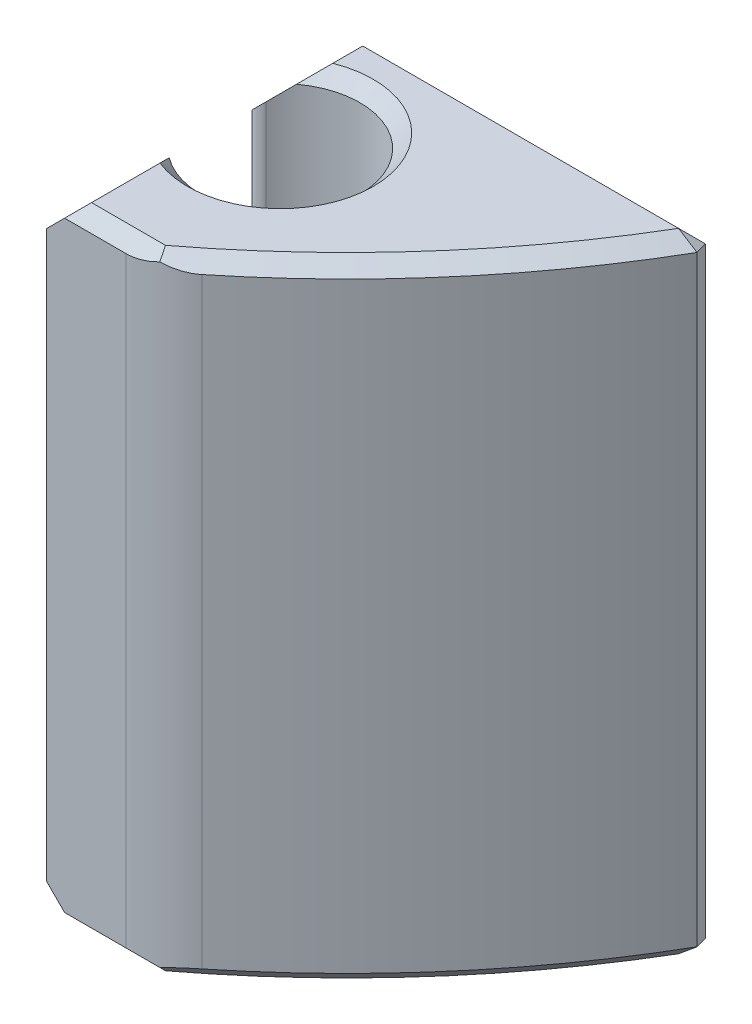
ISO-10303-21;
HEADER;
FILE_DESCRIPTION(('STEP AP214'),'2;1');
FILE_NAME('part.step','',(''),(''),'','','');
FILE_SCHEMA(('AUTOMOTIVE_DESIGN { 1 0 10303 214 1 1 1 1 }'));
ENDSEC;
DATA;
#1=APPLICATION_CONTEXT('core data for automotive mechanical design processes');
#2=APPLICATION_PROTOCOL_DEFINITION('international standard','automotive_design',2000,#1);
#3=PRODUCT_CONTEXT('',#1,'mechanical');
#4=PRODUCT('Part','Part','',(#3));
#5=PRODUCT_RELATED_PRODUCT_CATEGORY('part','',(#4));
#6=PRODUCT_DEFINITION_FORMATION('','',#4);
#7=PRODUCT_DEFINITION_CONTEXT('part definition',#1,'design');
#8=PRODUCT_DEFINITION('design','',#6,#7);
#9=PRODUCT_DEFINITION_SHAPE('','',#8);
#10=(LENGTH_UNIT() NAMED_UNIT(*) SI_UNIT(.MILLI.,.METRE.));
#11=(NAMED_UNIT(*) PLANE_ANGLE_UNIT() SI_UNIT($,.RADIAN.));
#12=(NAMED_UNIT(*) SI_UNIT($,.STERADIAN.) SOLID_ANGLE_UNIT());
#13=UNCERTAINTY_MEASURE_WITH_UNIT(LENGTH_MEASURE(1.E-05),#10,'distance_accuracy_value','');
#14=(GEOMETRIC_REPRESENTATION_CONTEXT(3) GLOBAL_UNCERTAINTY_ASSIGNED_CONTEXT((#13)) GLOBAL_UNIT_ASSIGNED_CONTEXT((#10,
#11,#12)) REPRESENTATION_CONTEXT('',''));
#15=CARTESIAN_POINT('',(0.,0.,0.));
#16=DIRECTION('',(0.,0.,1.));
#17=DIRECTION('',(1.,0.,0.));
#18=AXIS2_PLACEMENT_3D('',#15,#16,#17);
#19=CARTESIAN_POINT('',(0.,39.07282,0.));
#20=DIRECTION('',(0.,1.,0.));
#21=DIRECTION('',(0.,0.,1.));
#22=AXIS2_PLACEMENT_3D('',#19,#20,#21);
#23=PLANE('',#22);
#24=DIRECTION('',(0.,0.,-1.));
#25=VECTOR('',#24,1.);
#26=CARTESIAN_POINT('',(13.97,39.07282,17.0843639268979));
#27=LINE('',#26,#25);
#28=CARTESIAN_POINT('',(13.97,39.07282,21.209));
#29=VERTEX_POINT('',#28);
#30=CARTESIAN_POINT('',(13.97,39.07282,19.2736003821666));
#31=VERTEX_POINT('',#30);
#32=EDGE_CURVE('E504',#29,#31,#27,.T.);
#33=ORIENTED_EDGE('',*,*,#32,.T.);
#34=CARTESIAN_POINT('',(14.9331760640529,39.07282,16.8275));
#35=DIRECTION('',(0.,1.,0.));
#36=DIRECTION('',(0.,0.,1.));
#37=AXIS2_PLACEMENT_3D('',#34,#35,#36);
#38=CIRCLE('',#37,2.6289);
#39=CARTESIAN_POINT('',(13.97,39.07282,14.3813996178334));
#40=VERTEX_POINT('',#39);
#41=EDGE_CURVE('E385',#31,#40,#38,.T.);
#42=ORIENTED_EDGE('',*,*,#41,.T.);
#43=DIRECTION('',(0.,0.,-1.));
#44=VECTOR('',#43,1.);
#45=CARTESIAN_POINT('',(13.97,39.07282,13.5333201375271));
#46=LINE('',#45,#44);
#47=CARTESIAN_POINT('',(13.97,39.07282,13.5333201375271));
#48=VERTEX_POINT('',#47);
#49=EDGE_CURVE('E506',#40,#48,#46,.T.);
#50=ORIENTED_EDGE('',*,*,#49,.T.);
#51=DIRECTION('',(1.,0.,0.));
#52=VECTOR('',#51,1.);
#53=CARTESIAN_POINT('',(0.,39.07282,13.5333201375271));
#54=LINE('',#53,#52);
#55=CARTESIAN_POINT('',(22.9075334400106,39.07282,13.5333201375271));
#56=VERTEX_POINT('',#55);
#57=EDGE_CURVE('E249',#48,#56,#54,.T.);
#58=ORIENTED_EDGE('',*,*,#57,.T.);
#59=CARTESIAN_POINT('',(0.,39.07282,0.));
#60=DIRECTION('',(0.,1.,0.));
#61=DIRECTION('',(0.,0.,1.));
#62=AXIS2_PLACEMENT_3D('',#59,#60,#61);
#63=CIRCLE('',#62,26.6065);
#64=CARTESIAN_POINT('',(16.0649980158729,39.07282,21.209));
#65=VERTEX_POINT('',#64);
#66=EDGE_CURVE('E251',#56,#65,#63,.F.);
#67=ORIENTED_EDGE('',*,*,#66,.T.);
#68=DIRECTION('',(-1.,0.,0.));
#69=VECTOR('',#68,1.);
#70=CARTESIAN_POINT('',(0.,39.07282,21.209));
#71=LINE('',#70,#69);
#72=EDGE_CURVE('E254',#65,#29,#71,.T.);
#73=ORIENTED_EDGE('',*,*,#72,.T.);
#74=EDGE_LOOP('',(#33,#42,#50,#58,#67,#73));
#75=FACE_BOUND('',#74,.T.);
#76=ADVANCED_FACE('F36',(#75),#23,.F.);
#77=CARTESIAN_POINT('',(12.446,70.8113977714133,21.59));
#78=DIRECTION('',(0.,0.,-1.));
#79=DIRECTION('',(-1.,0.,0.));
#80=AXIS2_PLACEMENT_3D('',#77,#78,#79);
#81=PLANE('',#80);
#82=DIRECTION('',(1.,0.,0.));
#83=VECTOR('',#82,1.);
#84=CARTESIAN_POINT('',(12.446,39.45382,21.59));
#85=LINE('',#84,#83);
#86=CARTESIAN_POINT('',(13.589,39.45382,21.59));
#87=VERTEX_POINT('',#86);
#88=CARTESIAN_POINT('',(15.3224592102573,39.45382,21.59));
#89=VERTEX_POINT('',#88);
#90=EDGE_CURVE('E246',#87,#89,#85,.T.);
#91=ORIENTED_EDGE('',*,*,#90,.T.);
#92=DIRECTION('',(0.,-1.,0.));
#93=VECTOR('',#92,1.);
#94=CARTESIAN_POINT('',(15.3224592102573,70.8113977714133,21.59));
#95=LINE('',#94,#93);
#96=CARTESIAN_POINT('',(15.3224592102573,56.47182,21.59));
#97=VERTEX_POINT('',#96);
#98=EDGE_CURVE('E360',#89,#97,#95,.F.);
#99=ORIENTED_EDGE('',*,*,#98,.T.);
#100=DIRECTION('',(-1.,0.,0.));
#101=VECTOR('',#100,1.);
#102=CARTESIAN_POINT('',(12.446,56.47182,21.59));
#103=LINE('',#102,#101);
#104=CARTESIAN_POINT('',(13.589,56.47182,21.59));
#105=VERTEX_POINT('',#104);
#106=EDGE_CURVE('E241',#97,#105,#103,.T.);
#107=ORIENTED_EDGE('',*,*,#106,.T.);
#108=DIRECTION('',(-0.707106781186549,-0.707106781186547,0.));
#109=VECTOR('',#108,1.);
#110=CARTESIAN_POINT('',(12.7,55.58282,21.59));
#111=LINE('',#110,#109);
#112=CARTESIAN_POINT('',(13.081,55.96382,21.59));
#113=VERTEX_POINT('',#112);
#114=EDGE_CURVE('E512',#105,#113,#111,.T.);
#115=ORIENTED_EDGE('',*,*,#114,.T.);
#116=DIRECTION('',(0.,-1.,0.));
#117=VECTOR('',#116,1.);
#118=CARTESIAN_POINT('',(13.081,39.07282,21.59));
#119=LINE('',#118,#117);
#120=CARTESIAN_POINT('',(13.081,39.96182,21.59));
#121=VERTEX_POINT('',#120);
#122=EDGE_CURVE('E243',#113,#121,#119,.T.);
#123=ORIENTED_EDGE('',*,*,#122,.T.);
#124=DIRECTION('',(0.70710678118655,-0.707106781186546,0.));
#125=VECTOR('',#124,1.);
#126=CARTESIAN_POINT('',(12.7,40.34282,21.59));
#127=LINE('',#126,#125);
#128=EDGE_CURVE('E510',#121,#87,#127,.T.);
#129=ORIENTED_EDGE('',*,*,#128,.T.);
#130=EDGE_LOOP('',(#91,#99,#107,#115,#123,#129));
#131=FACE_BOUND('',#130,.T.);
#132=ADVANCED_FACE('F537',(#131),#81,.F.);
#133=CARTESIAN_POINT('',(23.5656875827972,70.8113977714133,13.1523201375271));
#134=DIRECTION('',(0.,0.,1.));
#135=DIRECTION('',(1.,0.,0.));
#136=AXIS2_PLACEMENT_3D('',#133,#134,#135);
#137=PLANE('',#136);
#138=DIRECTION('',(0.,1.,0.));
#139=VECTOR('',#138,1.);
#140=CARTESIAN_POINT('',(13.081,56.85282,13.1523201375271));
#141=LINE('',#140,#139);
#142=CARTESIAN_POINT('',(13.081,39.96182,13.1523201375271));
#143=VERTEX_POINT('',#142);
#144=CARTESIAN_POINT('',(13.081,55.96382,13.1523201375271));
#145=VERTEX_POINT('',#144);
#146=EDGE_CURVE('E201',#143,#145,#141,.T.);
#147=ORIENTED_EDGE('',*,*,#146,.T.);
#148=DIRECTION('',(0.707106781186544,0.707106781186551,0.));
#149=VECTOR('',#148,1.);
#150=CARTESIAN_POINT('',(12.7,55.58282,13.1523201375271));
#151=LINE('',#150,#149);
#152=CARTESIAN_POINT('',(13.589,56.47182,13.1523201375271));
#153=VERTEX_POINT('',#152);
#154=EDGE_CURVE('E198',#145,#153,#151,.T.);
#155=ORIENTED_EDGE('',*,*,#154,.T.);
#156=DIRECTION('',(1.,0.,0.));
#157=VECTOR('',#156,1.);
#158=CARTESIAN_POINT('',(23.5656875827972,56.47182,13.1523201375271));
#159=LINE('',#158,#157);
#160=CARTESIAN_POINT('',(23.2856550282447,56.47182,13.1523201375271));
#161=VERTEX_POINT('',#160);
#162=EDGE_CURVE('E190',#153,#161,#159,.T.);
#163=ORIENTED_EDGE('',*,*,#162,.T.);
#164=DIRECTION('',(0.,-1.,0.));
#165=VECTOR('',#164,1.);
#166=CARTESIAN_POINT('',(23.2856550282447,70.8113977714133,13.1523201375271));
#167=LINE('',#166,#165);
#168=CARTESIAN_POINT('',(23.2856550282447,39.45382,13.1523201375271));
#169=VERTEX_POINT('',#168);
#170=EDGE_CURVE('E196',#161,#169,#167,.T.);
#171=ORIENTED_EDGE('',*,*,#170,.T.);
#172=DIRECTION('',(-1.,0.,0.));
#173=VECTOR('',#172,1.);
#174=CARTESIAN_POINT('',(23.5656875827972,39.45382,13.1523201375271));
#175=LINE('',#174,#173);
#176=CARTESIAN_POINT('',(13.589,39.45382,13.1523201375271));
#177=VERTEX_POINT('',#176);
#178=EDGE_CURVE('E229',#169,#177,#175,.T.);
#179=ORIENTED_EDGE('',*,*,#178,.T.);
#180=DIRECTION('',(-0.707106781186544,0.707106781186551,0.));
#181=VECTOR('',#180,1.);
#182=CARTESIAN_POINT('',(12.7,40.34282,13.1523201375271));
#183=LINE('',#182,#181);
#184=EDGE_CURVE('E489',#177,#143,#183,.T.);
#185=ORIENTED_EDGE('',*,*,#184,.T.);
#186=EDGE_LOOP('',(#147,#155,#163,#171,#179,#185));
#187=FACE_BOUND('',#186,.T.);
#188=ADVANCED_FACE('F193',(#187),#137,.F.);
#189=CARTESIAN_POINT('',(14.9331760640529,70.8113977714133,16.8275));
#190=DIRECTION('',(0.,-1.,0.));
#191=DIRECTION('',(0.,0.,-1.));
#192=AXIS2_PLACEMENT_3D('',#189,#190,#191);
#193=CYLINDRICAL_SURFACE('',#192,2.2479);
#194=CARTESIAN_POINT('',(14.9331760640529,57.8159960640529,16.8275));
#195=DIRECTION('',(-0.707106781186551,0.707106781186544,0.));
#196=DIRECTION('',(-0.707106781186544,-0.707106781186551,0.));
#197=AXIS2_PLACEMENT_3D('',#194,#195,#196);
#198=ELLIPSE('',#197,3.1790106668585,2.2479);
#199=CARTESIAN_POINT('',(13.589,56.47182,15.0257660799032));
#200=VERTEX_POINT('',#199);
#201=CARTESIAN_POINT('',(13.1549315801069,56.0377515801069,15.4523996526378));
#202=VERTEX_POINT('',#201);
#203=EDGE_CURVE('E459',#200,#202,#198,.T.);
#204=ORIENTED_EDGE('',*,*,#203,.T.);
#205=DIRECTION('',(0.,-1.,0.));
#206=VECTOR('',#205,1.);
#207=CARTESIAN_POINT('',(13.1549315801069,70.8113977714133,15.4523996526378));
#208=LINE('',#207,#206);
#209=CARTESIAN_POINT('',(13.1549315801069,39.8878884198931,15.4523996526378));
#210=VERTEX_POINT('',#209);
#211=EDGE_CURVE('E531',#202,#210,#208,.T.);
#212=ORIENTED_EDGE('',*,*,#211,.T.);
#213=CARTESIAN_POINT('',(14.9331760640529,38.1096439359471,16.8275));
#214=DIRECTION('',(-0.707106781186551,-0.707106781186544,0.));
#215=DIRECTION('',(0.707106781186544,-0.707106781186551,0.));
#216=AXIS2_PLACEMENT_3D('',#213,#214,#215);
#217=ELLIPSE('',#216,3.1790106668585,2.2479);
#218=CARTESIAN_POINT('',(13.589,39.45382,15.0257660799032));
#219=VERTEX_POINT('',#218);
#220=EDGE_CURVE('E502',#210,#219,#217,.T.);
#221=ORIENTED_EDGE('',*,*,#220,.T.);
#222=CARTESIAN_POINT('',(14.9331760640529,39.45382,16.8275));
#223=DIRECTION('',(0.,1.,0.));
#224=DIRECTION('',(0.,0.,1.));
#225=AXIS2_PLACEMENT_3D('',#222,#223,#224);
#226=CIRCLE('',#225,2.2479);
#227=CARTESIAN_POINT('',(13.589,39.45382,18.6292339200968));
#228=VERTEX_POINT('',#227);
#229=EDGE_CURVE('E448',#219,#228,#226,.F.);
#230=ORIENTED_EDGE('',*,*,#229,.T.);
#231=CARTESIAN_POINT('',(14.9331760640529,38.1096439359472,16.8275));
#232=DIRECTION('',(-0.707106781186546,-0.70710678118655,0.));
#233=DIRECTION('',(0.70710678118655,-0.707106781186546,0.));
#234=AXIS2_PLACEMENT_3D('',#231,#232,#233);
#235=ELLIPSE('',#234,3.17901066685848,2.2479);
#236=CARTESIAN_POINT('',(13.1549315801069,39.8878884198931,18.2026003473622));
#237=VERTEX_POINT('',#236);
#238=EDGE_CURVE('E469',#228,#237,#235,.T.);
#239=ORIENTED_EDGE('',*,*,#238,.T.);
#240=DIRECTION('',(0.,-1.,0.));
#241=VECTOR('',#240,1.);
#242=CARTESIAN_POINT('',(13.1549315801069,70.8113977714133,18.2026003473622));
#243=LINE('',#242,#241);
#244=CARTESIAN_POINT('',(13.1549315801069,56.0377515801069,18.2026003473622));
#245=VERTEX_POINT('',#244);
#246=EDGE_CURVE('E334',#237,#245,#243,.F.);
#247=ORIENTED_EDGE('',*,*,#246,.T.);
#248=CARTESIAN_POINT('',(14.9331760640529,57.8159960640528,16.8275));
#249=DIRECTION('',(-0.707106781186547,0.707106781186549,0.));
#250=DIRECTION('',(-0.707106781186549,-0.707106781186547,0.));
#251=AXIS2_PLACEMENT_3D('',#248,#249,#250);
#252=ELLIPSE('',#251,3.17901066685848,2.2479);
#253=CARTESIAN_POINT('',(13.589,56.47182,18.6292339200968));
#254=VERTEX_POINT('',#253);
#255=EDGE_CURVE('E462',#245,#254,#252,.T.);
#256=ORIENTED_EDGE('',*,*,#255,.T.);
#257=CARTESIAN_POINT('',(14.9331760640529,56.47182,16.8275));
#258=DIRECTION('',(0.,-1.,0.));
#259=DIRECTION('',(0.,0.,-1.));
#260=AXIS2_PLACEMENT_3D('',#257,#258,#259);
#261=CIRCLE('',#260,2.2479);
#262=EDGE_CURVE('E427',#254,#200,#261,.F.);
#263=ORIENTED_EDGE('',*,*,#262,.T.);
#264=EDGE_LOOP('',(#204,#212,#221,#230,#239,#247,#256,#263));
#265=FACE_BOUND('',#264,.T.);
#266=ADVANCED_FACE('F457',(#265),#193,.F.);
#267=CARTESIAN_POINT('',(34.780382401578,56.85282,21.59));
#268=DIRECTION('',(0.,-1.,0.));
#269=DIRECTION('',(0.,0.,-1.));
#270=AXIS2_PLACEMENT_3D('',#267,#268,#269);
#271=PLANE('',#270);
#272=DIRECTION('',(0.,0.,1.));
#273=VECTOR('',#272,1.);
#274=CARTESIAN_POINT('',(13.97,56.85282,16.5706360731021));
#275=LINE('',#274,#273);
#276=CARTESIAN_POINT('',(13.97,56.85282,13.5333201375271));
#277=VERTEX_POINT('',#276);
#278=CARTESIAN_POINT('',(13.97,56.85282,14.3813996178334));
#279=VERTEX_POINT('',#278);
#280=EDGE_CURVE('E480',#277,#279,#275,.T.);
#281=ORIENTED_EDGE('',*,*,#280,.T.);
#282=CARTESIAN_POINT('',(14.9331760640529,56.85282,16.8275));
#283=DIRECTION('',(0.,-1.,0.));
#284=DIRECTION('',(0.,0.,-1.));
#285=AXIS2_PLACEMENT_3D('',#282,#283,#284);
#286=CIRCLE('',#285,2.62890000000001);
#287=CARTESIAN_POINT('',(13.97,56.85282,19.2736003821666));
#288=VERTEX_POINT('',#287);
#289=EDGE_CURVE('E449',#279,#288,#286,.T.);
#290=ORIENTED_EDGE('',*,*,#289,.T.);
#291=DIRECTION('',(0.,0.,1.));
#292=VECTOR('',#291,1.);
#293=CARTESIAN_POINT('',(13.97,56.85282,21.209));
#294=LINE('',#293,#292);
#295=CARTESIAN_POINT('',(13.97,56.85282,21.209));
#296=VERTEX_POINT('',#295);
#297=EDGE_CURVE('E484',#288,#296,#294,.T.);
#298=ORIENTED_EDGE('',*,*,#297,.T.);
#299=DIRECTION('',(1.,0.,0.));
#300=VECTOR('',#299,1.);
#301=CARTESIAN_POINT('',(34.780382401578,56.85282,21.209));
#302=LINE('',#301,#300);
#303=CARTESIAN_POINT('',(16.0649980158729,56.85282,21.209));
#304=VERTEX_POINT('',#303);
#305=EDGE_CURVE('E263',#296,#304,#302,.T.);
#306=ORIENTED_EDGE('',*,*,#305,.T.);
#307=CARTESIAN_POINT('',(0.,56.85282,0.));
#308=DIRECTION('',(0.,-1.,0.));
#309=DIRECTION('',(0.,0.,-1.));
#310=AXIS2_PLACEMENT_3D('',#307,#308,#309);
#311=CIRCLE('',#310,26.6065);
#312=CARTESIAN_POINT('',(22.9075334400106,56.85282,13.5333201375271));
#313=VERTEX_POINT('',#312);
#314=EDGE_CURVE('E261',#304,#313,#311,.F.);
#315=ORIENTED_EDGE('',*,*,#314,.T.);
#316=DIRECTION('',(-1.,0.,0.));
#317=VECTOR('',#316,1.);
#318=CARTESIAN_POINT('',(34.780382401578,56.85282,13.5333201375271));
#319=LINE('',#318,#317);
#320=EDGE_CURVE('E210',#313,#277,#319,.T.);
#321=ORIENTED_EDGE('',*,*,#320,.T.);
#322=EDGE_LOOP('',(#281,#290,#298,#306,#315,#321));
#323=FACE_BOUND('',#322,.T.);
#324=ADVANCED_FACE('F535',(#323),#271,.F.);
#325=CARTESIAN_POINT('',(0.,70.8113977714133,0.));
#326=DIRECTION('',(0.,-1.,0.));
#327=DIRECTION('',(0.,0.,-1.));
#328=AXIS2_PLACEMENT_3D('',#325,#326,#327);
#329=CYLINDRICAL_SURFACE('',#328,26.9875);
#330=CARTESIAN_POINT('',(0.,56.47182,0.));
#331=DIRECTION('',(0.,-1.,0.));
#332=DIRECTION('',(0.,0.,-1.));
#333=AXIS2_PLACEMENT_3D('',#330,#331,#332);
#334=CIRCLE('',#333,26.9875);
#335=CARTESIAN_POINT('',(23.3789843828194,56.47182,13.4814036909325));
#336=VERTEX_POINT('',#335);
#337=CARTESIAN_POINT('',(16.9144030243101,56.47182,21.0292207792208));
#338=VERTEX_POINT('',#337);
#339=EDGE_CURVE('E228',#336,#338,#334,.T.);
#340=ORIENTED_EDGE('',*,*,#339,.T.);
#341=DIRECTION('',(0.,-1.,0.));
#342=VECTOR('',#341,1.);
#343=CARTESIAN_POINT('',(16.9144030243101,70.8113977714133,21.0292207792208));
#344=LINE('',#343,#342);
#345=CARTESIAN_POINT('',(16.9144030243101,39.45382,21.0292207792208));
#346=VERTEX_POINT('',#345);
#347=EDGE_CURVE('E358',#338,#346,#344,.T.);
#348=ORIENTED_EDGE('',*,*,#347,.T.);
#349=CARTESIAN_POINT('',(0.,39.45382,0.));
#350=DIRECTION('',(0.,1.,0.));
#351=DIRECTION('',(0.,0.,1.));
#352=AXIS2_PLACEMENT_3D('',#349,#350,#351);
#353=CIRCLE('',#352,26.9875);
#354=CARTESIAN_POINT('',(23.3789843828194,39.45382,13.4814036909325));
#355=VERTEX_POINT('',#354);
#356=EDGE_CURVE('E239',#346,#355,#353,.T.);
#357=ORIENTED_EDGE('',*,*,#356,.T.);
#358=DIRECTION('',(0.,-1.,0.));
#359=VECTOR('',#358,1.);
#360=CARTESIAN_POINT('',(23.3789843828194,70.8113977714133,13.4814036909325));
#361=LINE('',#360,#359);
#362=EDGE_CURVE('E232',#355,#336,#361,.F.);
#363=ORIENTED_EDGE('',*,*,#362,.T.);
#364=EDGE_LOOP('',(#340,#348,#357,#363));
#365=FACE_BOUND('',#364,.T.);
#366=ADVANCED_FACE('F565',(#365),#329,.T.);
#367=CARTESIAN_POINT('',(12.7,0.,0.));
#368=DIRECTION('',(-1.,0.,0.));
#369=DIRECTION('',(0.,0.,1.));
#370=AXIS2_PLACEMENT_3D('',#367,#368,#369);
#371=PLANE('',#370);
#372=DIRECTION('',(0.,0.,1.));
#373=VECTOR('',#372,1.);
#374=CARTESIAN_POINT('',(12.7,40.34282,16.5706360731021));
#375=LINE('',#374,#373);
#376=CARTESIAN_POINT('',(12.7,40.34282,13.5333201375271));
#377=VERTEX_POINT('',#376);
#378=CARTESIAN_POINT('',(12.7,40.34282,15.2970210823143));
#379=VERTEX_POINT('',#378);
#380=EDGE_CURVE('E497',#377,#379,#375,.T.);
#381=ORIENTED_EDGE('',*,*,#380,.T.);
#382=DIRECTION('',(0.,-1.,0.));
#383=VECTOR('',#382,1.);
#384=CARTESIAN_POINT('',(12.7,0.,15.2970210823143));
#385=LINE('',#384,#383);
#386=CARTESIAN_POINT('',(12.7,55.58282,15.2970210823143));
#387=VERTEX_POINT('',#386);
#388=EDGE_CURVE('E528',#379,#387,#385,.F.);
#389=ORIENTED_EDGE('',*,*,#388,.T.);
#390=DIRECTION('',(0.,0.,-1.));
#391=VECTOR('',#390,1.);
#392=CARTESIAN_POINT('',(12.7,55.58282,13.5333201375271));
#393=LINE('',#392,#391);
#394=CARTESIAN_POINT('',(12.7,55.58282,13.5333201375271));
#395=VERTEX_POINT('',#394);
#396=EDGE_CURVE('E495',#387,#395,#393,.T.);
#397=ORIENTED_EDGE('',*,*,#396,.T.);
#398=DIRECTION('',(0.,-1.,0.));
#399=VECTOR('',#398,1.);
#400=CARTESIAN_POINT('',(12.7,39.07282,13.5333201375271));
#401=LINE('',#400,#399);
#402=EDGE_CURVE('E265',#395,#377,#401,.T.);
#403=ORIENTED_EDGE('',*,*,#402,.T.);
#404=EDGE_LOOP('',(#381,#389,#397,#403));
#405=FACE_BOUND('',#404,.T.);
#406=ADVANCED_FACE('F563',(#405),#371,.T.);
#407=DIRECTION('',(0.,0.,-1.));
#408=VECTOR('',#407,1.);
#409=CARTESIAN_POINT('',(12.7,55.58282,17.0843639268979));
#410=LINE('',#409,#408);
#411=CARTESIAN_POINT('',(12.7,55.58282,21.209));
#412=VERTEX_POINT('',#411);
#413=CARTESIAN_POINT('',(12.7,55.58282,18.3579789176857));
#414=VERTEX_POINT('',#413);
#415=EDGE_CURVE('E268',#412,#414,#410,.T.);
#416=ORIENTED_EDGE('',*,*,#415,.T.);
#417=DIRECTION('',(0.,-1.,0.));
#418=VECTOR('',#417,1.);
#419=CARTESIAN_POINT('',(12.7,0.,18.3579789176857));
#420=LINE('',#419,#418);
#421=CARTESIAN_POINT('',(12.7,40.34282,18.3579789176857));
#422=VERTEX_POINT('',#421);
#423=EDGE_CURVE('E44',#414,#422,#420,.T.);
#424=ORIENTED_EDGE('',*,*,#423,.T.);
#425=DIRECTION('',(0.,0.,1.));
#426=VECTOR('',#425,1.);
#427=CARTESIAN_POINT('',(12.7,40.34282,21.209));
#428=LINE('',#427,#426);
#429=CARTESIAN_POINT('',(12.7,40.34282,21.209));
#430=VERTEX_POINT('',#429);
#431=EDGE_CURVE('E518',#422,#430,#428,.T.);
#432=ORIENTED_EDGE('',*,*,#431,.T.);
#433=DIRECTION('',(0.,1.,0.));
#434=VECTOR('',#433,1.);
#435=CARTESIAN_POINT('',(12.7,56.85282,21.209));
#436=LINE('',#435,#434);
#437=EDGE_CURVE('E257',#430,#412,#436,.T.);
#438=ORIENTED_EDGE('',*,*,#437,.T.);
#439=EDGE_LOOP('',(#416,#424,#432,#438));
#440=FACE_BOUND('',#439,.T.);
#441=ADVANCED_FACE('F519',(#440),#371,.T.);
#442=CARTESIAN_POINT('',(12.7,0.,21.209));
#443=DIRECTION('',(-0.707106781186548,0.,0.707106781186548));
#444=DIRECTION('',(0.,-1.,0.));
#445=AXIS2_PLACEMENT_3D('',#442,#443,#444);
#446=PLANE('',#445);
#447=ORIENTED_EDGE('',*,*,#437,.F.);
#448=DIRECTION('',(0.577350269189627,-0.577350269189624,0.577350269189627));
#449=VECTOR('',#448,1.);
#450=CARTESIAN_POINT('',(26.1476066666666,26.8952133333334,34.6566066666666));
#451=LINE('',#450,#449);
#452=EDGE_CURVE('E514',#430,#121,#451,.T.);
#453=ORIENTED_EDGE('',*,*,#452,.T.);
#454=ORIENTED_EDGE('',*,*,#122,.F.);
#455=DIRECTION('',(-0.577350269189626,-0.577350269189625,-0.577350269189626));
#456=VECTOR('',#455,1.);
#457=CARTESIAN_POINT('',(-5.82760666666664,37.0552133333334,2.68139333333335));
#458=LINE('',#457,#456);
#459=EDGE_CURVE('E516',#113,#412,#458,.T.);
#460=ORIENTED_EDGE('',*,*,#459,.T.);
#461=EDGE_LOOP('',(#447,#453,#454,#460));
#462=FACE_BOUND('',#461,.T.);
#463=ADVANCED_FACE('F410',(#462),#446,.T.);
#464=CARTESIAN_POINT('',(12.446,56.47182,21.59));
#465=DIRECTION('',(0.,-0.707106781186548,-0.707106781186548));
#466=DIRECTION('',(-1.,0.,0.));
#467=AXIS2_PLACEMENT_3D('',#464,#465,#466);
#468=PLANE('',#467);
#469=ORIENTED_EDGE('',*,*,#106,.F.);
#470=CARTESIAN_POINT('',(15.3224592102573,59.01182,19.05));
#471=DIRECTION('',(0.,-0.707106781186548,-0.707106781186548));
#472=DIRECTION('',(0.,-0.707106781186548,0.707106781186548));
#473=AXIS2_PLACEMENT_3D('',#470,#471,#472);
#474=ELLIPSE('',#473,3.59210244842766,2.54);
#475=CARTESIAN_POINT('',(16.1466255225549,56.6092484839627,21.4525715160373));
#476=VERTEX_POINT('',#475);
#477=EDGE_CURVE('E335',#97,#476,#474,.F.);
#478=ORIENTED_EDGE('',*,*,#477,.T.);
#479=CARTESIAN_POINT('',(16.0649980158729,56.85282,21.209));
#480=CARTESIAN_POINT('',(16.0863278873173,56.7893333090985,21.2724866909015));
#481=CARTESIAN_POINT('',(16.1076179883982,56.7258399636034,21.3359800363966));
#482=CARTESIAN_POINT('',(16.1501186497737,56.5988399636034,21.4629800363966));
#483=CARTESIAN_POINT('',(16.1713292100685,56.5353333090984,21.5264866909016));
#484=CARTESIAN_POINT('',(16.1925,56.47182,21.59));
#485=B_SPLINE_CURVE_WITH_KNOTS('',3,(#479,#480,#481,#482,#483,#484),.UNSPECIFIED.,.F.,.F.,(4,2,
4),(0.,0.276847799765602,0.553695598759203),.UNSPECIFIED.);
#486=EDGE_CURVE('E202',#304,#476,#485,.T.);
#487=ORIENTED_EDGE('',*,*,#486,.F.);
#488=ORIENTED_EDGE('',*,*,#305,.F.);
#489=DIRECTION('',(0.577350269189627,0.577350269189625,-0.577350269189625));
#490=VECTOR('',#489,1.);
#491=CARTESIAN_POINT('',(13.208,56.09082,21.971));
#492=LINE('',#491,#490);
#493=EDGE_CURVE('E476',#296,#105,#492,.F.);
#494=ORIENTED_EDGE('',*,*,#493,.T.);
#495=EDGE_LOOP('',(#469,#478,#487,#488,#494));
#496=FACE_BOUND('',#495,.T.);
#497=ADVANCED_FACE('F321',(#496),#468,.F.);
#498=CARTESIAN_POINT('',(12.7,0.,13.5333201375271));
#499=DIRECTION('',(-0.707106781186548,0.,-0.707106781186548));
#500=DIRECTION('',(0.,1.,0.));
#501=AXIS2_PLACEMENT_3D('',#498,#499,#500);
#502=PLANE('',#501);
#503=ORIENTED_EDGE('',*,*,#402,.F.);
#504=DIRECTION('',(0.577350269189624,0.57735026918963,-0.577350269189624));
#505=VECTOR('',#504,1.);
#506=CARTESIAN_POINT('',(-5.82760666666672,37.055213333333,32.0609268041938));
#507=LINE('',#506,#505);
#508=EDGE_CURVE('E491',#395,#145,#507,.T.);
#509=ORIENTED_EDGE('',*,*,#508,.T.);
#510=ORIENTED_EDGE('',*,*,#146,.F.);
#511=DIRECTION('',(-0.577350269189624,0.57735026918963,0.577350269189624));
#512=VECTOR('',#511,1.);
#513=CARTESIAN_POINT('',(26.1476066666667,26.8952133333332,0.0857134708603484));
#514=LINE('',#513,#512);
#515=EDGE_CURVE('E493',#143,#377,#514,.T.);
#516=ORIENTED_EDGE('',*,*,#515,.T.);
#517=EDGE_LOOP('',(#503,#509,#510,#516));
#518=FACE_BOUND('',#517,.T.);
#519=ADVANCED_FACE('F302',(#518),#502,.T.);
#520=CARTESIAN_POINT('',(12.446,39.45382,21.59));
#521=DIRECTION('',(0.,0.707106781186548,-0.707106781186548));
#522=DIRECTION('',(1.,0.,0.));
#523=AXIS2_PLACEMENT_3D('',#520,#521,#522);
#524=PLANE('',#523);
#525=CARTESIAN_POINT('',(16.1925,39.45382,21.59));
#526=CARTESIAN_POINT('',(16.1713292100685,39.3903066909016,21.5264866909016));
#527=CARTESIAN_POINT('',(16.1501186497737,39.3268000363966,21.4629800363966));
#528=CARTESIAN_POINT('',(16.1076179883982,39.1998000363966,21.3359800363966));
#529=CARTESIAN_POINT('',(16.0863278873173,39.1363066909015,21.2724866909015));
#530=CARTESIAN_POINT('',(16.0649980158729,39.07282,21.209));
#531=B_SPLINE_CURVE_WITH_KNOTS('',3,(#525,#526,#527,#528,#529,#530),.UNSPECIFIED.,.F.,.F.,(4,2,
4),(0.,0.276847798993593,0.553695598759204),.UNSPECIFIED.);
#532=CARTESIAN_POINT('',(16.1466255225489,39.3163915160193,21.4525715160193));
#533=VERTEX_POINT('',#532);
#534=EDGE_CURVE('E274',#533,#65,#531,.T.);
#535=ORIENTED_EDGE('',*,*,#534,.F.);
#536=CARTESIAN_POINT('',(15.3224592102573,36.91382,19.05));
#537=DIRECTION('',(0.,0.707106781186548,-0.707106781186548));
#538=DIRECTION('',(0.,-0.707106781186548,-0.707106781186548));
#539=AXIS2_PLACEMENT_3D('',#536,#537,#538);
#540=ELLIPSE('',#539,3.59210244842766,2.54);
#541=EDGE_CURVE('E357',#533,#89,#540,.F.);
#542=ORIENTED_EDGE('',*,*,#541,.T.);
#543=ORIENTED_EDGE('',*,*,#90,.F.);
#544=DIRECTION('',(-0.577350269189628,0.577350269189625,0.577350269189625));
#545=VECTOR('',#544,1.);
#546=CARTESIAN_POINT('',(13.208,39.83482,21.971));
#547=LINE('',#546,#545);
#548=EDGE_CURVE('E508',#87,#29,#547,.F.);
#549=ORIENTED_EDGE('',*,*,#548,.T.);
#550=ORIENTED_EDGE('',*,*,#72,.F.);
#551=EDGE_LOOP('',(#535,#542,#543,#549,#550));
#552=FACE_BOUND('',#551,.T.);
#553=ADVANCED_FACE('F294',(#552),#524,.F.);
#554=CARTESIAN_POINT('',(0.,56.47182,0.));
#555=DIRECTION('',(0.,-1.,0.));
#556=DIRECTION('',(0.,0.,-1.));
#557=AXIS2_PLACEMENT_3D('',#554,#555,#556);
#558=CONICAL_SURFACE('',#557,26.9875,0.785398163397448);
#559=ORIENTED_EDGE('',*,*,#486,.T.);
#560=CARTESIAN_POINT('',(16.1466255225549,56.6092484839627,21.4525715160373));
#561=CARTESIAN_POINT('',(16.1970832207679,56.592728688507,21.4352712125806));
#562=CARTESIAN_POINT('',(16.2473966283061,56.577543027433,21.4162273018473));
#563=CARTESIAN_POINT('',(16.3474155400525,56.550012031659,21.3746483471324));
#564=CARTESIAN_POINT('',(16.3971203688189,56.5376696221499,21.3521097472696));
#565=CARTESIAN_POINT('',(16.4945457379124,56.5162412234661,21.3040427819566));
#566=CARTESIAN_POINT('',(16.5422860640756,56.5070968225986,21.2785807369449));
#567=CARTESIAN_POINT('',(16.6363705370296,56.4918823375583,21.2244376409852));
#568=CARTESIAN_POINT('',(16.6827157301113,56.4858098926521,21.1957590826305));
#569=CARTESIAN_POINT('',(16.760055246113,56.4781720649641,21.1443691462646));
#570=CARTESIAN_POINT('',(16.7914940266984,56.4758018015361,21.1224394136587));
#571=CARTESIAN_POINT('',(16.8536113458626,56.4726194296004,21.0769847359574));
#572=CARTESIAN_POINT('',(16.8842831704827,56.4718181472024,21.0534498588651));
#573=CARTESIAN_POINT('',(16.9144030243101,56.47182,21.0292207792208));
#574=B_SPLINE_CURVE_WITH_KNOTS('',3,(#560,#561,#562,#563,#564,#565,#566,#567,#568,#569,#570,
#571,#572,#573),.UNSPECIFIED.,.F.,.F.,(4,2,2,2,2,2,4),(0.,0.167502443889549,0.335176455389154,
0.499604693371593,0.663906379033449,0.779053361847255,0.894992107750248),.UNSPECIFIED.);
#575=EDGE_CURVE('E326',#476,#338,#574,.T.);
#576=ORIENTED_EDGE('',*,*,#575,.T.);
#577=ORIENTED_EDGE('',*,*,#339,.F.);
#578=CARTESIAN_POINT('',(27.1629591126581,48.798054851487,-7.70351910962717));
#579=DIRECTION('',(0.607598899954212,0.775325931460967,-0.172317372248464));
#580=DIRECTION('',(0.745908859020303,-0.631561319274846,-0.211542605710634));
#581=AXIS2_PLACEMENT_3D('',#578,#579,#580);
#582=ELLIPSE('',#581,44.7054119332755,20.1055402132645);
#583=EDGE_CURVE('E214',#313,#336,#582,.T.);
#584=ORIENTED_EDGE('',*,*,#583,.F.);
#585=ORIENTED_EDGE('',*,*,#314,.F.);
#586=EDGE_LOOP('',(#559,#576,#577,#584,#585));
#587=FACE_BOUND('',#586,.T.);
#588=ADVANCED_FACE('F301',(#587),#558,.T.);
#589=CARTESIAN_POINT('',(23.5656875827972,56.47182,13.1523201375271));
#590=DIRECTION('',(0.,-0.707106781186546,0.707106781186549));
#591=DIRECTION('',(1.,0.,0.));
#592=AXIS2_PLACEMENT_3D('',#589,#590,#591);
#593=PLANE('',#592);
#594=ORIENTED_EDGE('',*,*,#162,.F.);
#595=DIRECTION('',(-0.577350269189622,-0.577350269189629,-0.577350269189626));
#596=VECTOR('',#595,1.);
#597=CARTESIAN_POINT('',(16.914562527599,59.797382527599,16.4778826651261));
#598=LINE('',#597,#596);
#599=EDGE_CURVE('E486',#153,#277,#598,.F.);
#600=ORIENTED_EDGE('',*,*,#599,.T.);
#601=ORIENTED_EDGE('',*,*,#320,.F.);
#602=DIRECTION('',(0.574431389286766,-0.578804189256643,-0.57880418925664));
#603=VECTOR('',#602,1.);
#604=CARTESIAN_POINT('',(23.2070362639729,56.5510372415425,13.2315373790695));
#605=LINE('',#604,#603);
#606=EDGE_CURVE('E206',#161,#313,#605,.F.);
#607=ORIENTED_EDGE('',*,*,#606,.F.);
#608=EDGE_LOOP('',(#594,#600,#601,#607));
#609=FACE_BOUND('',#608,.T.);
#610=ADVANCED_FACE('F208',(#609),#593,.F.);
#611=CARTESIAN_POINT('',(23.5656875827972,39.45382,13.1523201375271));
#612=DIRECTION('',(0.,0.707106781186546,0.707106781186549));
#613=DIRECTION('',(-1.,0.,0.));
#614=AXIS2_PLACEMENT_3D('',#611,#612,#613);
#615=PLANE('',#614);
#616=ORIENTED_EDGE('',*,*,#57,.F.);
#617=DIRECTION('',(0.577350269189623,-0.577350269189629,0.577350269189626));
#618=VECTOR('',#617,1.);
#619=CARTESIAN_POINT('',(16.914562527599,36.128257472401,16.4778826651261));
#620=LINE('',#619,#618);
#621=EDGE_CURVE('E475',#48,#177,#620,.F.);
#622=ORIENTED_EDGE('',*,*,#621,.T.);
#623=ORIENTED_EDGE('',*,*,#178,.F.);
#624=DIRECTION('',(-0.574431389286766,-0.578804189256643,0.57880418925664));
#625=VECTOR('',#624,1.);
#626=CARTESIAN_POINT('',(23.2856550282447,39.45382,13.1523201375271));
#627=LINE('',#626,#625);
#628=EDGE_CURVE('E215',#56,#169,#627,.F.);
#629=ORIENTED_EDGE('',*,*,#628,.F.);
#630=EDGE_LOOP('',(#616,#622,#623,#629));
#631=FACE_BOUND('',#630,.T.);
#632=ADVANCED_FACE('F304',(#631),#615,.F.);
#633=CARTESIAN_POINT('',(0.,39.45382,0.));
#634=DIRECTION('',(0.,1.,0.));
#635=DIRECTION('',(0.,0.,1.));
#636=AXIS2_PLACEMENT_3D('',#633,#634,#635);
#637=CONICAL_SURFACE('',#636,26.9875,0.785398163397448);
#638=ORIENTED_EDGE('',*,*,#356,.F.);
#639=CARTESIAN_POINT('',(16.9144030243101,39.45382,21.0292207792208));
#640=CARTESIAN_POINT('',(16.870881152848,39.4538301886966,21.0642420032449));
#641=CARTESIAN_POINT('',(16.8261940106244,39.4521510491161,21.0978054845321));
#642=CARTESIAN_POINT('',(16.7348783843294,39.445488150166,21.1618154115714));
#643=CARTESIAN_POINT('',(16.6882500099835,39.4405045773378,21.192262033164));
#644=CARTESIAN_POINT('',(16.5943070208165,39.427428059522,21.2493118072456));
#645=CARTESIAN_POINT('',(16.5470207491602,39.4193939179952,21.2759752919526));
#646=CARTESIAN_POINT('',(16.4513377695291,39.4003445256134,21.3259931337635));
#647=CARTESIAN_POINT('',(16.4029415373953,39.389330531142,21.3493488791882));
#648=CARTESIAN_POINT('',(16.3199893207333,39.3682014082328,21.3862221177759));
#649=CARTESIAN_POINT('',(16.2856244959321,39.358803206026,21.4005924767957));
#650=CARTESIAN_POINT('',(16.2164079960436,39.3386189134624,21.4277822336209));
#651=CARTESIAN_POINT('',(16.1815546050542,39.3278240866382,21.4405907886753));
#652=CARTESIAN_POINT('',(16.1466255225528,39.3163915160366,21.452571516038));
#653=B_SPLINE_CURVE_WITH_KNOTS('',3,(#639,#640,#641,#642,#643,#644,#645,#646,#647,#648,#649,
#650,#651,#652),.UNSPECIFIED.,.F.,.F.,(4,2,2,2,2,2,4),(0.,0.167523552061763,0.335037647912522,
0.499474379916651,0.663841888863841,0.779033899106212,0.894984881673225),.UNSPECIFIED.);
#654=EDGE_CURVE('E350',#346,#533,#653,.T.);
#655=ORIENTED_EDGE('',*,*,#654,.T.);
#656=ORIENTED_EDGE('',*,*,#534,.T.);
#657=ORIENTED_EDGE('',*,*,#66,.F.);
#658=CARTESIAN_POINT('',(27.1629591126581,47.127585148513,-7.70351910962717));
#659=DIRECTION('',(0.607598899954212,-0.775325931460967,-0.172317372248464));
#660=DIRECTION('',(0.745908859020303,0.631561319274846,-0.211542605710634));
#661=AXIS2_PLACEMENT_3D('',#658,#659,#660);
#662=ELLIPSE('',#661,44.7054119332755,20.1055402132645);
#663=EDGE_CURVE('E222',#355,#56,#662,.T.);
#664=ORIENTED_EDGE('',*,*,#663,.F.);
#665=EDGE_LOOP('',(#638,#655,#656,#657,#664));
#666=FACE_BOUND('',#665,.T.);
#667=ADVANCED_FACE('F290',(#666),#637,.T.);
#668=CARTESIAN_POINT('',(23.3789843828194,56.47182,13.4814036909325));
#669=DIRECTION('',(0.607598899954212,0.775325931460967,-0.172317372248464));
#670=DIRECTION('',(-0.787099776857564,0.616825697641378,0.));
#671=AXIS2_PLACEMENT_3D('',#668,#669,#670);
#672=PLANE('',#671);
#673=ORIENTED_EDGE('',*,*,#606,.T.);
#674=ORIENTED_EDGE('',*,*,#583,.T.);
#675=DIRECTION('',(0.272843454767491,0.,0.962058443749932));
#676=VECTOR('',#675,1.);
#677=CARTESIAN_POINT('',(23.3789843828194,56.47182,13.4814036909325));
#678=LINE('',#677,#676);
#679=EDGE_CURVE('E217',#161,#336,#678,.T.);
#680=ORIENTED_EDGE('',*,*,#679,.F.);
#681=EDGE_LOOP('',(#673,#674,#680));
#682=FACE_BOUND('',#681,.T.);
#683=ADVANCED_FACE('F218',(#682),#672,.T.);
#684=CARTESIAN_POINT('',(23.2856550282447,39.45382,13.1523201375271));
#685=DIRECTION('',(0.607598899954212,-0.775325931460967,-0.172317372248464));
#686=DIRECTION('',(0.787099776857564,0.616825697641378,0.));
#687=AXIS2_PLACEMENT_3D('',#684,#685,#686);
#688=PLANE('',#687);
#689=ORIENTED_EDGE('',*,*,#663,.T.);
#690=ORIENTED_EDGE('',*,*,#628,.T.);
#691=DIRECTION('',(-0.272843454767491,0.,-0.962058443749932));
#692=VECTOR('',#691,1.);
#693=CARTESIAN_POINT('',(23.2856550282447,39.45382,13.1523201375271));
#694=LINE('',#693,#692);
#695=EDGE_CURVE('E223',#355,#169,#694,.T.);
#696=ORIENTED_EDGE('',*,*,#695,.F.);
#697=EDGE_LOOP('',(#689,#690,#696));
#698=FACE_BOUND('',#697,.T.);
#699=ADVANCED_FACE('F590',(#698),#688,.T.);
#700=CARTESIAN_POINT('',(23.2856550282447,70.8113977714133,13.1523201375271));
#701=DIRECTION('',(-0.962058443749932,0.,0.272843454767491));
#702=DIRECTION('',(0.,-1.,0.));
#703=AXIS2_PLACEMENT_3D('',#700,#701,#702);
#704=PLANE('',#703);
#705=ORIENTED_EDGE('',*,*,#679,.T.);
#706=ORIENTED_EDGE('',*,*,#362,.F.);
#707=ORIENTED_EDGE('',*,*,#695,.T.);
#708=ORIENTED_EDGE('',*,*,#170,.F.);
#709=EDGE_LOOP('',(#705,#706,#707,#708));
#710=FACE_BOUND('',#709,.T.);
#711=ADVANCED_FACE('F225',(#710),#704,.F.);
#712=CARTESIAN_POINT('',(12.7,40.34282,0.));
#713=DIRECTION('',(-0.707106781186546,-0.70710678118655,0.));
#714=DIRECTION('',(0.,0.,-1.));
#715=AXIS2_PLACEMENT_3D('',#712,#713,#714);
#716=PLANE('',#715);
#717=ORIENTED_EDGE('',*,*,#431,.F.);
#718=CARTESIAN_POINT('',(12.954,40.08882,18.3579789176857));
#719=DIRECTION('',(-0.707106781186546,-0.70710678118655,0.));
#720=DIRECTION('',(0.70710678118655,-0.707106781186546,0.));
#721=AXIS2_PLACEMENT_3D('',#718,#719,#720);
#722=ELLIPSE('',#721,0.359210244842765,0.254);
#723=EDGE_CURVE('E11',#422,#237,#722,.T.);
#724=ORIENTED_EDGE('',*,*,#723,.T.);
#725=ORIENTED_EDGE('',*,*,#238,.F.);
#726=CARTESIAN_POINT('',(13.589,39.45382,18.6292339200968));
#727=CARTESIAN_POINT('',(13.6176923809459,39.4251276190541,18.686429961916));
#728=CARTESIAN_POINT('',(13.6472837680684,39.3955362319316,18.742709501882));
#729=CARTESIAN_POINT('',(13.7080264826707,39.3347935173293,18.8534360302185));
#730=CARTESIAN_POINT('',(13.7391755853966,39.3036444146034,18.907885456346));
#731=CARTESIAN_POINT('',(13.8028674583875,39.2399525416125,19.0150955289639));
#732=CARTESIAN_POINT('',(13.83540983101,39.20741016899,19.0678566498871));
#733=CARTESIAN_POINT('',(13.9017852956436,39.1410347043564,19.1718643012271));
#734=CARTESIAN_POINT('',(13.9356201194472,39.1071998805528,19.2231086236375));
#735=CARTESIAN_POINT('',(13.97,39.07282,19.2736003821666));
#736=B_SPLINE_CURVE_WITH_KNOTS('',3,(#726,#727,#728,#729,#730,#731,#732,#733,#734,#735),
.UNSPECIFIED.,.F.,.F.,(4,2,2,2,4),(0.,0.210348536369751,0.420404782657284,0.630401472929299,
0.840690157926957),.UNSPECIFIED.);
#737=EDGE_CURVE('E377',#228,#31,#736,.T.);
#738=ORIENTED_EDGE('',*,*,#737,.T.);
#739=ORIENTED_EDGE('',*,*,#32,.F.);
#740=ORIENTED_EDGE('',*,*,#548,.F.);
#741=ORIENTED_EDGE('',*,*,#128,.F.);
#742=ORIENTED_EDGE('',*,*,#452,.F.);
#743=EDGE_LOOP('',(#717,#724,#725,#738,#739,#740,#741,#742));
#744=FACE_BOUND('',#743,.T.);
#745=ADVANCED_FACE('F399',(#744),#716,.T.);
#746=CARTESIAN_POINT('',(12.7,55.58282,0.));
#747=DIRECTION('',(-0.707106781186551,0.707106781186544,0.));
#748=DIRECTION('',(0.,0.,1.));
#749=AXIS2_PLACEMENT_3D('',#746,#747,#748);
#750=PLANE('',#749);
#751=ORIENTED_EDGE('',*,*,#396,.F.);
#752=CARTESIAN_POINT('',(12.954,55.83682,15.2970210823143));
#753=DIRECTION('',(-0.707106781186551,0.707106781186544,0.));
#754=DIRECTION('',(-0.707106781186544,-0.707106781186551,0.));
#755=AXIS2_PLACEMENT_3D('',#752,#753,#754);
#756=ELLIPSE('',#755,0.359210244842768,0.254);
#757=EDGE_CURVE('E468',#387,#202,#756,.T.);
#758=ORIENTED_EDGE('',*,*,#757,.T.);
#759=ORIENTED_EDGE('',*,*,#203,.F.);
#760=CARTESIAN_POINT('',(13.589,56.47182,15.0257660799032));
#761=CARTESIAN_POINT('',(13.6176923809459,56.5005123809458,14.968570038084));
#762=CARTESIAN_POINT('',(13.6472837680684,56.5301037680684,14.912290498118));
#763=CARTESIAN_POINT('',(13.7080264826707,56.5908464826706,14.8015639697815));
#764=CARTESIAN_POINT('',(13.7391755853966,56.6219955853966,14.747114543654));
#765=CARTESIAN_POINT('',(13.8028674583875,56.6856874583875,14.6399044710361));
#766=CARTESIAN_POINT('',(13.83540983101,56.71822983101,14.5871433501129));
#767=CARTESIAN_POINT('',(13.9017852956436,56.7846052956436,14.4831356987729));
#768=CARTESIAN_POINT('',(13.9356201194472,56.8184401194472,14.4318913763625));
#769=CARTESIAN_POINT('',(13.97,56.85282,14.3813996178334));
#770=B_SPLINE_CURVE_WITH_KNOTS('',3,(#760,#761,#762,#763,#764,#765,#766,#767,#768,#769),
.UNSPECIFIED.,.F.,.F.,(4,2,2,2,4),(0.,0.210348536369748,0.420404782657289,0.630401472929312,
0.84069015792697),.UNSPECIFIED.);
#771=EDGE_CURVE('E421',#200,#279,#770,.T.);
#772=ORIENTED_EDGE('',*,*,#771,.T.);
#773=ORIENTED_EDGE('',*,*,#280,.F.);
#774=ORIENTED_EDGE('',*,*,#599,.F.);
#775=ORIENTED_EDGE('',*,*,#154,.F.);
#776=ORIENTED_EDGE('',*,*,#508,.F.);
#777=EDGE_LOOP('',(#751,#758,#759,#772,#773,#774,#775,#776));
#778=FACE_BOUND('',#777,.T.);
#779=ADVANCED_FACE('F408',(#778),#750,.T.);
#780=CARTESIAN_POINT('',(12.7,55.58282,0.));
#781=DIRECTION('',(-0.707106781186547,0.707106781186549,0.));
#782=DIRECTION('',(0.,0.,1.));
#783=AXIS2_PLACEMENT_3D('',#780,#781,#782);
#784=PLANE('',#783);
#785=ORIENTED_EDGE('',*,*,#255,.F.);
#786=CARTESIAN_POINT('',(12.954,55.83682,18.3579789176857));
#787=DIRECTION('',(-0.707106781186547,0.707106781186549,0.));
#788=DIRECTION('',(-0.707106781186549,-0.707106781186547,0.));
#789=AXIS2_PLACEMENT_3D('',#786,#787,#788);
#790=ELLIPSE('',#789,0.359210244842766,0.254);
#791=EDGE_CURVE('E58',#245,#414,#790,.T.);
#792=ORIENTED_EDGE('',*,*,#791,.T.);
#793=ORIENTED_EDGE('',*,*,#415,.F.);
#794=ORIENTED_EDGE('',*,*,#459,.F.);
#795=ORIENTED_EDGE('',*,*,#114,.F.);
#796=ORIENTED_EDGE('',*,*,#493,.F.);
#797=ORIENTED_EDGE('',*,*,#297,.F.);
#798=CARTESIAN_POINT('',(13.97,56.85282,19.2736003821666));
#799=CARTESIAN_POINT('',(13.9356201194472,56.8184401194472,19.2231086236375));
#800=CARTESIAN_POINT('',(13.9017852956436,56.7846052956436,19.1718643012271));
#801=CARTESIAN_POINT('',(13.83540983101,56.71822983101,19.0678566498871));
#802=CARTESIAN_POINT('',(13.8028674583875,56.6856874583875,19.0150955289639));
#803=CARTESIAN_POINT('',(13.7391755853966,56.6219955853966,18.907885456346));
#804=CARTESIAN_POINT('',(13.7080264826707,56.5908464826706,18.8534360302185));
#805=CARTESIAN_POINT('',(13.6472837680684,56.5301037680684,18.742709501882));
#806=CARTESIAN_POINT('',(13.6176923809459,56.5005123809458,18.686429961916));
#807=CARTESIAN_POINT('',(13.589,56.47182,18.6292339200968));
#808=B_SPLINE_CURVE_WITH_KNOTS('',3,(#798,#799,#800,#801,#802,#803,#804,#805,#806,#807),
.UNSPECIFIED.,.F.,.F.,(4,2,2,2,4),(0.,0.210288684997661,0.420285375269683,0.63034162155723,
0.840690157926977),.UNSPECIFIED.);
#809=EDGE_CURVE('E441',#288,#254,#808,.T.);
#810=ORIENTED_EDGE('',*,*,#809,.T.);
#811=EDGE_LOOP('',(#785,#792,#793,#794,#795,#796,#797,#810));
#812=FACE_BOUND('',#811,.T.);
#813=ADVANCED_FACE('F417',(#812),#784,.T.);
#814=CARTESIAN_POINT('',(12.7,40.34282,0.));
#815=DIRECTION('',(-0.707106781186551,-0.707106781186544,0.));
#816=DIRECTION('',(0.,0.,-1.));
#817=AXIS2_PLACEMENT_3D('',#814,#815,#816);
#818=PLANE('',#817);
#819=ORIENTED_EDGE('',*,*,#220,.F.);
#820=CARTESIAN_POINT('',(12.954,40.08882,15.2970210823143));
#821=DIRECTION('',(-0.707106781186551,-0.707106781186544,0.));
#822=DIRECTION('',(0.707106781186544,-0.707106781186551,0.));
#823=AXIS2_PLACEMENT_3D('',#820,#821,#822);
#824=ELLIPSE('',#823,0.359210244842768,0.254);
#825=EDGE_CURVE('E530',#210,#379,#824,.T.);
#826=ORIENTED_EDGE('',*,*,#825,.T.);
#827=ORIENTED_EDGE('',*,*,#380,.F.);
#828=ORIENTED_EDGE('',*,*,#515,.F.);
#829=ORIENTED_EDGE('',*,*,#184,.F.);
#830=ORIENTED_EDGE('',*,*,#621,.F.);
#831=ORIENTED_EDGE('',*,*,#49,.F.);
#832=CARTESIAN_POINT('',(13.97,39.07282,14.3813996178334));
#833=CARTESIAN_POINT('',(13.9356201194472,39.1071998805528,14.4318913763625));
#834=CARTESIAN_POINT('',(13.9017852956436,39.1410347043564,14.4831356987729));
#835=CARTESIAN_POINT('',(13.83540983101,39.20741016899,14.5871433501129));
#836=CARTESIAN_POINT('',(13.8028674583875,39.2399525416125,14.6399044710361));
#837=CARTESIAN_POINT('',(13.7391755853966,39.3036444146034,14.747114543654));
#838=CARTESIAN_POINT('',(13.7080264826707,39.3347935173294,14.8015639697815));
#839=CARTESIAN_POINT('',(13.6472837680684,39.3955362319316,14.912290498118));
#840=CARTESIAN_POINT('',(13.6176923809459,39.4251276190542,14.968570038084));
#841=CARTESIAN_POINT('',(13.589,39.45382,15.0257660799032));
#842=B_SPLINE_CURVE_WITH_KNOTS('',3,(#832,#833,#834,#835,#836,#837,#838,#839,#840,#841),
.UNSPECIFIED.,.F.,.F.,(4,2,2,2,4),(0.,0.210288684997658,0.420285375269674,0.630341621557212,
0.840690157926957),.UNSPECIFIED.);
#843=EDGE_CURVE('E378',#40,#219,#842,.T.);
#844=ORIENTED_EDGE('',*,*,#843,.T.);
#845=EDGE_LOOP('',(#819,#826,#827,#828,#829,#830,#831,#844));
#846=FACE_BOUND('',#845,.T.);
#847=ADVANCED_FACE('F436',(#846),#818,.T.);
#848=CARTESIAN_POINT('',(14.9331760640529,56.85282,16.8275));
#849=DIRECTION('',(0.,1.,0.));
#850=DIRECTION('',(0.,0.,1.));
#851=AXIS2_PLACEMENT_3D('',#848,#849,#850);
#852=CONICAL_SURFACE('',#851,2.62890000000001,0.785398163397444);
#853=ORIENTED_EDGE('',*,*,#771,.F.);
#854=ORIENTED_EDGE('',*,*,#262,.F.);
#855=ORIENTED_EDGE('',*,*,#809,.F.);
#856=ORIENTED_EDGE('',*,*,#289,.F.);
#857=EDGE_LOOP('',(#853,#854,#855,#856));
#858=FACE_BOUND('',#857,.T.);
#859=ADVANCED_FACE('F430',(#858),#852,.F.);
#860=CARTESIAN_POINT('',(14.9331760640529,39.07282,16.8275));
#861=DIRECTION('',(0.,-1.,0.));
#862=DIRECTION('',(0.,0.,-1.));
#863=AXIS2_PLACEMENT_3D('',#860,#861,#862);
#864=CONICAL_SURFACE('',#863,2.6289,0.785398163397444);
#865=ORIENTED_EDGE('',*,*,#737,.F.);
#866=ORIENTED_EDGE('',*,*,#229,.F.);
#867=ORIENTED_EDGE('',*,*,#843,.F.);
#868=ORIENTED_EDGE('',*,*,#41,.F.);
#869=EDGE_LOOP('',(#865,#866,#867,#868));
#870=FACE_BOUND('',#869,.T.);
#871=ADVANCED_FACE('F343',(#870),#864,.F.);
#872=CARTESIAN_POINT('',(15.3224592102573,70.8113977714133,19.05));
#873=DIRECTION('',(0.,-1.,0.));
#874=DIRECTION('',(0.,0.,-1.));
#875=AXIS2_PLACEMENT_3D('',#872,#873,#874);
#876=CYLINDRICAL_SURFACE('',#875,2.54);
#877=ORIENTED_EDGE('',*,*,#477,.F.);
#878=ORIENTED_EDGE('',*,*,#98,.F.);
#879=ORIENTED_EDGE('',*,*,#541,.F.);
#880=ORIENTED_EDGE('',*,*,#654,.F.);
#881=ORIENTED_EDGE('',*,*,#347,.F.);
#882=ORIENTED_EDGE('',*,*,#575,.F.);
#883=EDGE_LOOP('',(#877,#878,#879,#880,#881,#882));
#884=FACE_BOUND('',#883,.T.);
#885=ADVANCED_FACE('F338',(#884),#876,.T.);
#886=CARTESIAN_POINT('',(12.954,70.8113977714133,15.2970210823143));
#887=DIRECTION('',(0.,-1.,0.));
#888=DIRECTION('',(0.,0.,-1.));
#889=AXIS2_PLACEMENT_3D('',#886,#887,#888);
#890=CYLINDRICAL_SURFACE('',#889,0.254);
#891=ORIENTED_EDGE('',*,*,#757,.F.);
#892=ORIENTED_EDGE('',*,*,#388,.F.);
#893=ORIENTED_EDGE('',*,*,#825,.F.);
#894=ORIENTED_EDGE('',*,*,#211,.F.);
#895=EDGE_LOOP('',(#891,#892,#893,#894));
#896=FACE_BOUND('',#895,.T.);
#897=ADVANCED_FACE('F342',(#896),#890,.T.);
#898=CARTESIAN_POINT('',(12.954,70.8113977714133,18.3579789176857));
#899=DIRECTION('',(0.,-1.,0.));
#900=DIRECTION('',(0.,0.,-1.));
#901=AXIS2_PLACEMENT_3D('',#898,#899,#900);
#902=CYLINDRICAL_SURFACE('',#901,0.254);
#903=ORIENTED_EDGE('',*,*,#723,.F.);
#904=ORIENTED_EDGE('',*,*,#423,.F.);
#905=ORIENTED_EDGE('',*,*,#791,.F.);
#906=ORIENTED_EDGE('',*,*,#246,.F.);
#907=EDGE_LOOP('',(#903,#904,#905,#906));
#908=FACE_BOUND('',#907,.T.);
#909=ADVANCED_FACE('F38',(#908),#902,.T.);
#910=CLOSED_SHELL('',(#76,#132,#188,#266,#324,#366,#406,#441,#463,#497,#519,#553,#588,#610,#632,
#667,#683,#699,#711,#745,#779,#813,#847,#859,#871,#885,#897,#909));
#911=MANIFOLD_SOLID_BREP('B2',#910);
#912=ADVANCED_BREP_SHAPE_REPRESENTATION('',(#18,#911),#14);
#913=SHAPE_DEFINITION_REPRESENTATION(#9,#912);
ENDSEC;
END-ISO-10303-21;
